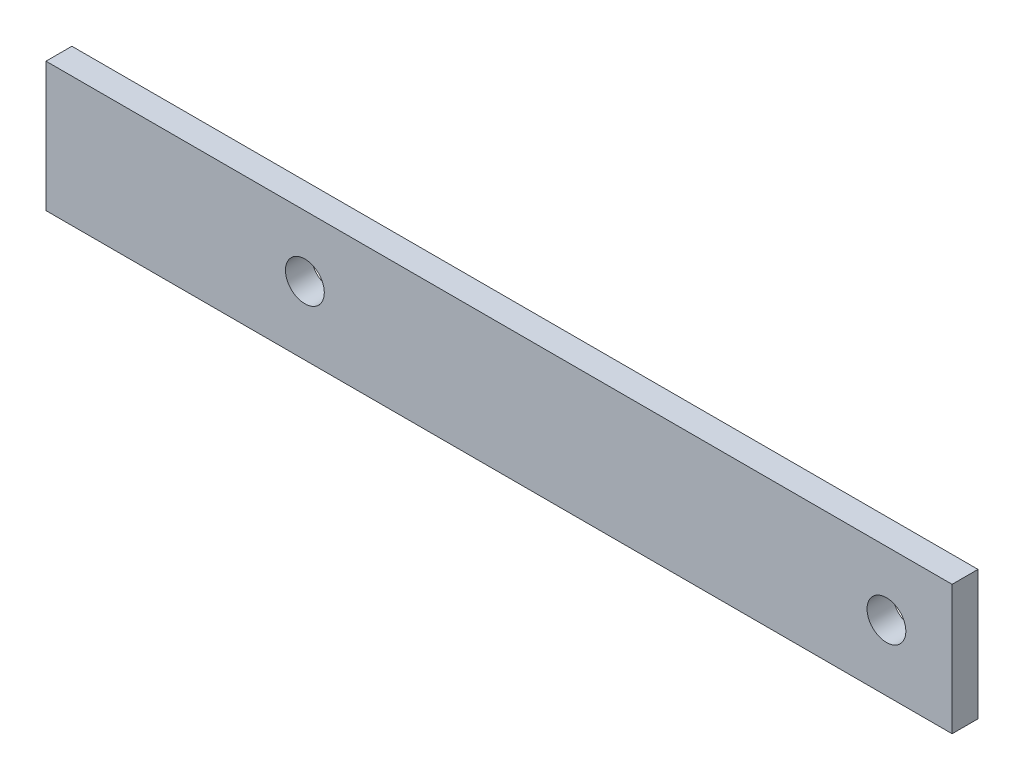
ISO-10303-21;
HEADER;
FILE_DESCRIPTION(('STEP AP214'),'2;1');
FILE_NAME('part.step','',(''),(''),'','','');
FILE_SCHEMA(('AUTOMOTIVE_DESIGN { 1 0 10303 214 1 1 1 1 }'));
ENDSEC;
DATA;
#1=APPLICATION_CONTEXT('core data for automotive mechanical design processes');
#2=APPLICATION_PROTOCOL_DEFINITION('international standard','automotive_design',2000,#1);
#3=PRODUCT_CONTEXT('',#1,'mechanical');
#4=PRODUCT('Part','Part','',(#3));
#5=PRODUCT_RELATED_PRODUCT_CATEGORY('part','',(#4));
#6=PRODUCT_DEFINITION_FORMATION('','',#4);
#7=PRODUCT_DEFINITION_CONTEXT('part definition',#1,'design');
#8=PRODUCT_DEFINITION('design','',#6,#7);
#9=PRODUCT_DEFINITION_SHAPE('','',#8);
#10=(LENGTH_UNIT() NAMED_UNIT(*) SI_UNIT(.MILLI.,.METRE.));
#11=(NAMED_UNIT(*) PLANE_ANGLE_UNIT() SI_UNIT($,.RADIAN.));
#12=(NAMED_UNIT(*) SI_UNIT($,.STERADIAN.) SOLID_ANGLE_UNIT());
#13=UNCERTAINTY_MEASURE_WITH_UNIT(LENGTH_MEASURE(1.E-05),#10,'distance_accuracy_value','');
#14=(GEOMETRIC_REPRESENTATION_CONTEXT(3) GLOBAL_UNCERTAINTY_ASSIGNED_CONTEXT((#13)) GLOBAL_UNIT_ASSIGNED_CONTEXT((#10,
#11,#12)) REPRESENTATION_CONTEXT('',''));
#15=CARTESIAN_POINT('',(0.,0.,0.));
#16=DIRECTION('',(0.,0.,1.));
#17=DIRECTION('',(1.,0.,0.));
#18=AXIS2_PLACEMENT_3D('',#15,#16,#17);
#19=CARTESIAN_POINT('',(-70.,0.,2.));
#20=DIRECTION('',(1.,0.,0.));
#21=DIRECTION('',(0.,0.,-1.));
#22=AXIS2_PLACEMENT_3D('',#19,#20,#21);
#23=PLANE('',#22);
#24=DIRECTION('',(0.,-1.,0.));
#25=VECTOR('',#24,1.);
#26=CARTESIAN_POINT('',(-70.,0.,0.));
#27=LINE('',#26,#25);
#28=CARTESIAN_POINT('',(-70.,0.,0.));
#29=VERTEX_POINT('',#28);
#30=CARTESIAN_POINT('',(-70.,-10.,0.));
#31=VERTEX_POINT('',#30);
#32=EDGE_CURVE('E98',#29,#31,#27,.T.);
#33=ORIENTED_EDGE('',*,*,#32,.T.);
#34=DIRECTION('',(0.,0.,-1.));
#35=VECTOR('',#34,1.);
#36=CARTESIAN_POINT('',(-70.,-10.,2.));
#37=LINE('',#36,#35);
#38=CARTESIAN_POINT('',(-70.,-10.,2.));
#39=VERTEX_POINT('',#38);
#40=EDGE_CURVE('E11',#39,#31,#37,.T.);
#41=ORIENTED_EDGE('',*,*,#40,.F.);
#42=DIRECTION('',(0.,-1.,0.));
#43=VECTOR('',#42,1.);
#44=CARTESIAN_POINT('',(-70.,0.,2.));
#45=LINE('',#44,#43);
#46=CARTESIAN_POINT('',(-70.,0.,2.));
#47=VERTEX_POINT('',#46);
#48=EDGE_CURVE('E85',#47,#39,#45,.T.);
#49=ORIENTED_EDGE('',*,*,#48,.F.);
#50=DIRECTION('',(0.,0.,-1.));
#51=VECTOR('',#50,1.);
#52=CARTESIAN_POINT('',(-70.,0.,2.));
#53=LINE('',#52,#51);
#54=EDGE_CURVE('E94',#47,#29,#53,.T.);
#55=ORIENTED_EDGE('',*,*,#54,.T.);
#56=EDGE_LOOP('',(#33,#41,#49,#55));
#57=FACE_BOUND('',#56,.T.);
#58=ADVANCED_FACE('F33',(#57),#23,.F.);
#59=CARTESIAN_POINT('',(-70.,-10.,2.));
#60=DIRECTION('',(0.,1.,0.));
#61=DIRECTION('',(-1.,0.,0.));
#62=AXIS2_PLACEMENT_3D('',#59,#60,#61);
#63=PLANE('',#62);
#64=DIRECTION('',(1.,0.,0.));
#65=VECTOR('',#64,1.);
#66=CARTESIAN_POINT('',(-70.,-10.,0.));
#67=LINE('',#66,#65);
#68=CARTESIAN_POINT('',(0.,-9.99999999999999,0.));
#69=VERTEX_POINT('',#68);
#70=EDGE_CURVE('E89',#31,#69,#67,.T.);
#71=ORIENTED_EDGE('',*,*,#70,.T.);
#72=DIRECTION('',(0.,0.,-1.));
#73=VECTOR('',#72,1.);
#74=CARTESIAN_POINT('',(0.,-9.99999999999999,2.));
#75=LINE('',#74,#73);
#76=CARTESIAN_POINT('',(0.,-9.99999999999999,2.));
#77=VERTEX_POINT('',#76);
#78=EDGE_CURVE('E42',#77,#69,#75,.T.);
#79=ORIENTED_EDGE('',*,*,#78,.F.);
#80=DIRECTION('',(1.,0.,0.));
#81=VECTOR('',#80,1.);
#82=CARTESIAN_POINT('',(-70.,-10.,2.));
#83=LINE('',#82,#81);
#84=EDGE_CURVE('E80',#39,#77,#83,.T.);
#85=ORIENTED_EDGE('',*,*,#84,.F.);
#86=ORIENTED_EDGE('',*,*,#40,.T.);
#87=EDGE_LOOP('',(#71,#79,#85,#86));
#88=FACE_BOUND('',#87,.T.);
#89=ADVANCED_FACE('F88',(#88),#63,.F.);
#90=CARTESIAN_POINT('',(0.,0.,2.));
#91=DIRECTION('',(-1.,0.,0.));
#92=DIRECTION('',(0.,0.,1.));
#93=AXIS2_PLACEMENT_3D('',#90,#91,#92);
#94=PLANE('',#93);
#95=DIRECTION('',(0.,1.,0.));
#96=VECTOR('',#95,1.);
#97=CARTESIAN_POINT('',(0.,0.,0.));
#98=LINE('',#97,#96);
#99=CARTESIAN_POINT('',(0.,0.,0.));
#100=VERTEX_POINT('',#99);
#101=EDGE_CURVE('E67',#69,#100,#98,.T.);
#102=ORIENTED_EDGE('',*,*,#101,.T.);
#103=DIRECTION('',(0.,0.,-1.));
#104=VECTOR('',#103,1.);
#105=CARTESIAN_POINT('',(0.,0.,2.));
#106=LINE('',#105,#104);
#107=CARTESIAN_POINT('',(0.,0.,2.));
#108=VERTEX_POINT('',#107);
#109=EDGE_CURVE('E90',#108,#100,#106,.T.);
#110=ORIENTED_EDGE('',*,*,#109,.F.);
#111=DIRECTION('',(0.,1.,0.));
#112=VECTOR('',#111,1.);
#113=CARTESIAN_POINT('',(0.,0.,2.));
#114=LINE('',#113,#112);
#115=EDGE_CURVE('E83',#77,#108,#114,.T.);
#116=ORIENTED_EDGE('',*,*,#115,.F.);
#117=ORIENTED_EDGE('',*,*,#78,.T.);
#118=EDGE_LOOP('',(#102,#110,#116,#117));
#119=FACE_BOUND('',#118,.T.);
#120=ADVANCED_FACE('F92',(#119),#94,.F.);
#121=CARTESIAN_POINT('',(-70.,0.,2.));
#122=DIRECTION('',(0.,-1.,0.));
#123=DIRECTION('',(1.,0.,0.));
#124=AXIS2_PLACEMENT_3D('',#121,#122,#123);
#125=PLANE('',#124);
#126=DIRECTION('',(-1.,0.,0.));
#127=VECTOR('',#126,1.);
#128=CARTESIAN_POINT('',(-70.,0.,0.));
#129=LINE('',#128,#127);
#130=EDGE_CURVE('E73',#100,#29,#129,.T.);
#131=ORIENTED_EDGE('',*,*,#130,.T.);
#132=ORIENTED_EDGE('',*,*,#54,.F.);
#133=DIRECTION('',(-1.,0.,0.));
#134=VECTOR('',#133,1.);
#135=CARTESIAN_POINT('',(-70.,0.,2.));
#136=LINE('',#135,#134);
#137=EDGE_CURVE('E50',#108,#47,#136,.T.);
#138=ORIENTED_EDGE('',*,*,#137,.F.);
#139=ORIENTED_EDGE('',*,*,#109,.T.);
#140=EDGE_LOOP('',(#131,#132,#138,#139));
#141=FACE_BOUND('',#140,.T.);
#142=ADVANCED_FACE('F106',(#141),#125,.F.);
#143=CARTESIAN_POINT('',(0.,0.,2.));
#144=DIRECTION('',(0.,0.,1.));
#145=DIRECTION('',(1.,0.,0.));
#146=AXIS2_PLACEMENT_3D('',#143,#144,#145);
#147=PLANE('',#146);
#148=CARTESIAN_POINT('',(-50.,-4.73323343857816,2.));
#149=DIRECTION('',(0.,0.,1.));
#150=DIRECTION('',(1.,0.,0.));
#151=AXIS2_PLACEMENT_3D('',#148,#149,#150);
#152=CIRCLE('',#151,1.5);
#153=CARTESIAN_POINT('',(-48.5,-4.73323343857816,2.));
#154=VERTEX_POINT('',#153);
#155=EDGE_CURVE('E117',#154,#154,#152,.T.);
#156=ORIENTED_EDGE('',*,*,#155,.F.);
#157=EDGE_LOOP('',(#156));
#158=FACE_BOUND('',#157,.T.);
#159=CARTESIAN_POINT('',(-5.07364210958855,-4.92859278185749,2.));
#160=DIRECTION('',(0.,0.,1.));
#161=DIRECTION('',(1.,0.,0.));
#162=AXIS2_PLACEMENT_3D('',#159,#160,#161);
#163=CIRCLE('',#162,1.5);
#164=CARTESIAN_POINT('',(-3.57364210958855,-4.92859278185749,2.));
#165=VERTEX_POINT('',#164);
#166=EDGE_CURVE('E112',#165,#165,#163,.T.);
#167=ORIENTED_EDGE('',*,*,#166,.F.);
#168=EDGE_LOOP('',(#167));
#169=FACE_BOUND('',#168,.T.);
#170=ORIENTED_EDGE('',*,*,#48,.T.);
#171=ORIENTED_EDGE('',*,*,#84,.T.);
#172=ORIENTED_EDGE('',*,*,#115,.T.);
#173=ORIENTED_EDGE('',*,*,#137,.T.);
#174=EDGE_LOOP('',(#170,#171,#172,#173));
#175=FACE_BOUND('',#174,.T.);
#176=ADVANCED_FACE('F81',(#158,#169,#175),#147,.T.);
#177=CARTESIAN_POINT('',(0.,0.,0.));
#178=DIRECTION('',(0.,0.,1.));
#179=DIRECTION('',(1.,0.,0.));
#180=AXIS2_PLACEMENT_3D('',#177,#178,#179);
#181=PLANE('',#180);
#182=CARTESIAN_POINT('',(-50.,-4.73323343857816,0.));
#183=DIRECTION('',(0.,0.,1.));
#184=DIRECTION('',(1.,0.,0.));
#185=AXIS2_PLACEMENT_3D('',#182,#183,#184);
#186=CIRCLE('',#185,1.5);
#187=CARTESIAN_POINT('',(-48.5,-4.73323343857816,0.));
#188=VERTEX_POINT('',#187);
#189=EDGE_CURVE('E36',#188,#188,#186,.T.);
#190=ORIENTED_EDGE('',*,*,#189,.T.);
#191=EDGE_LOOP('',(#190));
#192=FACE_BOUND('',#191,.T.);
#193=CARTESIAN_POINT('',(-5.07364210958855,-4.92859278185749,0.));
#194=DIRECTION('',(0.,0.,1.));
#195=DIRECTION('',(1.,0.,0.));
#196=AXIS2_PLACEMENT_3D('',#193,#194,#195);
#197=CIRCLE('',#196,1.5);
#198=CARTESIAN_POINT('',(-3.57364210958855,-4.92859278185749,0.));
#199=VERTEX_POINT('',#198);
#200=EDGE_CURVE('E101',#199,#199,#197,.T.);
#201=ORIENTED_EDGE('',*,*,#200,.T.);
#202=EDGE_LOOP('',(#201));
#203=FACE_BOUND('',#202,.T.);
#204=ORIENTED_EDGE('',*,*,#32,.F.);
#205=ORIENTED_EDGE('',*,*,#130,.F.);
#206=ORIENTED_EDGE('',*,*,#101,.F.);
#207=ORIENTED_EDGE('',*,*,#70,.F.);
#208=EDGE_LOOP('',(#204,#205,#206,#207));
#209=FACE_BOUND('',#208,.T.);
#210=ADVANCED_FACE('F109',(#192,#203,#209),#181,.F.);
#211=CARTESIAN_POINT('',(-5.07364210958855,-4.92859278185749,0.));
#212=DIRECTION('',(0.,0.,1.));
#213=DIRECTION('',(1.,0.,0.));
#214=AXIS2_PLACEMENT_3D('',#211,#212,#213);
#215=CYLINDRICAL_SURFACE('',#214,1.5);
#216=ORIENTED_EDGE('',*,*,#200,.F.);
#217=EDGE_LOOP('',(#216));
#218=FACE_BOUND('',#217,.T.);
#219=ORIENTED_EDGE('',*,*,#166,.T.);
#220=EDGE_LOOP('',(#219));
#221=FACE_BOUND('',#220,.T.);
#222=ADVANCED_FACE('F128',(#218,#221),#215,.F.);
#223=CARTESIAN_POINT('',(-50.,-4.73323343857816,-8.));
#224=DIRECTION('',(0.,0.,1.));
#225=DIRECTION('',(1.,0.,0.));
#226=AXIS2_PLACEMENT_3D('',#223,#224,#225);
#227=CYLINDRICAL_SURFACE('',#226,1.5);
#228=ORIENTED_EDGE('',*,*,#155,.T.);
#229=EDGE_LOOP('',(#228));
#230=FACE_BOUND('',#229,.T.);
#231=ORIENTED_EDGE('',*,*,#189,.F.);
#232=EDGE_LOOP('',(#231));
#233=FACE_BOUND('',#232,.T.);
#234=ADVANCED_FACE('F126',(#230,#233),#227,.F.);
#235=CLOSED_SHELL('',(#58,#89,#120,#142,#176,#210,#222,#234));
#236=MANIFOLD_SOLID_BREP('B2',#235);
#237=ADVANCED_BREP_SHAPE_REPRESENTATION('',(#18,#236),#14);
#238=SHAPE_DEFINITION_REPRESENTATION(#9,#237);
ENDSEC;
END-ISO-10303-21;
